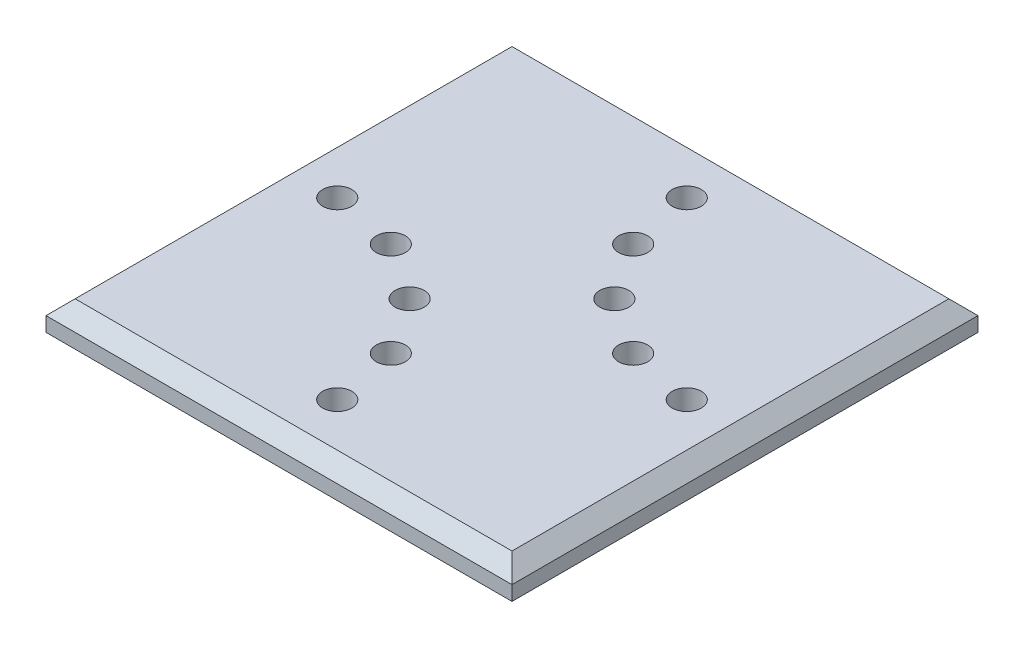
ISO-10303-21;
HEADER;
FILE_DESCRIPTION(('STEP AP214'),'2;1');
FILE_NAME('part.step','',(''),(''),'','','');
FILE_SCHEMA(('AUTOMOTIVE_DESIGN { 1 0 10303 214 1 1 1 1 }'));
ENDSEC;
DATA;
#1=APPLICATION_CONTEXT('core data for automotive mechanical design processes');
#2=APPLICATION_PROTOCOL_DEFINITION('international standard','automotive_design',2000,#1);
#3=PRODUCT_CONTEXT('',#1,'mechanical');
#4=PRODUCT('Part','Part','',(#3));
#5=PRODUCT_RELATED_PRODUCT_CATEGORY('part','',(#4));
#6=PRODUCT_DEFINITION_FORMATION('','',#4);
#7=PRODUCT_DEFINITION_CONTEXT('part definition',#1,'design');
#8=PRODUCT_DEFINITION('design','',#6,#7);
#9=PRODUCT_DEFINITION_SHAPE('','',#8);
#10=(LENGTH_UNIT() NAMED_UNIT(*) SI_UNIT(.MILLI.,.METRE.));
#11=(NAMED_UNIT(*) PLANE_ANGLE_UNIT() SI_UNIT($,.RADIAN.));
#12=(NAMED_UNIT(*) SI_UNIT($,.STERADIAN.) SOLID_ANGLE_UNIT());
#13=UNCERTAINTY_MEASURE_WITH_UNIT(LENGTH_MEASURE(1.E-05),#10,'distance_accuracy_value','');
#14=(GEOMETRIC_REPRESENTATION_CONTEXT(3) GLOBAL_UNCERTAINTY_ASSIGNED_CONTEXT((#13)) GLOBAL_UNIT_ASSIGNED_CONTEXT((#10,
#11,#12)) REPRESENTATION_CONTEXT('',''));
#15=CARTESIAN_POINT('',(0.,0.,0.));
#16=DIRECTION('',(0.,0.,1.));
#17=DIRECTION('',(1.,0.,0.));
#18=AXIS2_PLACEMENT_3D('',#15,#16,#17);
#19=CARTESIAN_POINT('',(50.8,9.525,50.8));
#20=DIRECTION('',(-1.,0.,0.));
#21=DIRECTION('',(0.,0.,1.));
#22=AXIS2_PLACEMENT_3D('',#19,#20,#21);
#23=PLANE('',#22);
#24=DIRECTION('',(0.,-1.,0.));
#25=VECTOR('',#24,1.);
#26=CARTESIAN_POINT('',(50.8,9.525,-50.8));
#27=LINE('',#26,#25);
#28=CARTESIAN_POINT('',(50.8,6.34999999999995,-50.8));
#29=VERTEX_POINT('',#28);
#30=CARTESIAN_POINT('',(50.8,3.175,-50.8));
#31=VERTEX_POINT('',#30);
#32=EDGE_CURVE('E175',#29,#31,#27,.T.);
#33=ORIENTED_EDGE('',*,*,#32,.F.);
#34=DIRECTION('',(0.,0.,1.));
#35=VECTOR('',#34,1.);
#36=CARTESIAN_POINT('',(50.8,6.34999999999995,50.8));
#37=LINE('',#36,#35);
#38=CARTESIAN_POINT('',(50.8,6.34999999999995,50.8));
#39=VERTEX_POINT('',#38);
#40=EDGE_CURVE('E11',#29,#39,#37,.T.);
#41=ORIENTED_EDGE('',*,*,#40,.T.);
#42=DIRECTION('',(0.,-1.,0.));
#43=VECTOR('',#42,1.);
#44=CARTESIAN_POINT('',(50.8,9.525,50.8));
#45=LINE('',#44,#43);
#46=CARTESIAN_POINT('',(50.8,3.175,50.8));
#47=VERTEX_POINT('',#46);
#48=EDGE_CURVE('E169',#39,#47,#45,.T.);
#49=ORIENTED_EDGE('',*,*,#48,.T.);
#50=DIRECTION('',(0.,0.,1.));
#51=VECTOR('',#50,1.);
#52=CARTESIAN_POINT('',(50.8,3.175,-50.8));
#53=LINE('',#52,#51);
#54=EDGE_CURVE('E160',#31,#47,#53,.T.);
#55=ORIENTED_EDGE('',*,*,#54,.F.);
#56=EDGE_LOOP('',(#33,#41,#49,#55));
#57=FACE_BOUND('',#56,.T.);
#58=ADVANCED_FACE('F32',(#57),#23,.F.);
#59=CARTESIAN_POINT('',(-50.8,9.525,-50.8));
#60=DIRECTION('',(0.,0.,1.));
#61=DIRECTION('',(1.,0.,0.));
#62=AXIS2_PLACEMENT_3D('',#59,#60,#61);
#63=PLANE('',#62);
#64=DIRECTION('',(0.,-1.,0.));
#65=VECTOR('',#64,1.);
#66=CARTESIAN_POINT('',(-50.8,9.525,-50.8));
#67=LINE('',#66,#65);
#68=CARTESIAN_POINT('',(-50.8,6.34999999999995,-50.8));
#69=VERTEX_POINT('',#68);
#70=CARTESIAN_POINT('',(-50.8,3.175,-50.8));
#71=VERTEX_POINT('',#70);
#72=EDGE_CURVE('E173',#69,#71,#67,.T.);
#73=ORIENTED_EDGE('',*,*,#72,.F.);
#74=DIRECTION('',(1.,0.,0.));
#75=VECTOR('',#74,1.);
#76=CARTESIAN_POINT('',(-50.8,6.34999999999995,-50.8));
#77=LINE('',#76,#75);
#78=EDGE_CURVE('E41',#69,#29,#77,.T.);
#79=ORIENTED_EDGE('',*,*,#78,.T.);
#80=ORIENTED_EDGE('',*,*,#32,.T.);
#81=DIRECTION('',(1.,0.,0.));
#82=VECTOR('',#81,1.);
#83=CARTESIAN_POINT('',(-50.8,3.175,-50.8));
#84=LINE('',#83,#82);
#85=EDGE_CURVE('E154',#71,#31,#84,.T.);
#86=ORIENTED_EDGE('',*,*,#85,.F.);
#87=EDGE_LOOP('',(#73,#79,#80,#86));
#88=FACE_BOUND('',#87,.T.);
#89=ADVANCED_FACE('F236',(#88),#63,.F.);
#90=CARTESIAN_POINT('',(-50.8,9.525,50.8));
#91=DIRECTION('',(1.,0.,0.));
#92=DIRECTION('',(0.,0.,-1.));
#93=AXIS2_PLACEMENT_3D('',#90,#91,#92);
#94=PLANE('',#93);
#95=DIRECTION('',(0.,-1.,0.));
#96=VECTOR('',#95,1.);
#97=CARTESIAN_POINT('',(-50.8,9.525,50.8));
#98=LINE('',#97,#96);
#99=CARTESIAN_POINT('',(-50.8,6.34999999999995,50.8));
#100=VERTEX_POINT('',#99);
#101=CARTESIAN_POINT('',(-50.8,3.175,50.8));
#102=VERTEX_POINT('',#101);
#103=EDGE_CURVE('E171',#100,#102,#98,.T.);
#104=ORIENTED_EDGE('',*,*,#103,.F.);
#105=DIRECTION('',(0.,0.,-1.));
#106=VECTOR('',#105,1.);
#107=CARTESIAN_POINT('',(-50.8,6.34999999999995,50.8));
#108=LINE('',#107,#106);
#109=EDGE_CURVE('E56',#100,#69,#108,.T.);
#110=ORIENTED_EDGE('',*,*,#109,.T.);
#111=ORIENTED_EDGE('',*,*,#72,.T.);
#112=DIRECTION('',(0.,0.,-1.));
#113=VECTOR('',#112,1.);
#114=CARTESIAN_POINT('',(-50.8,3.175,50.8));
#115=LINE('',#114,#113);
#116=EDGE_CURVE('E166',#102,#71,#115,.T.);
#117=ORIENTED_EDGE('',*,*,#116,.F.);
#118=EDGE_LOOP('',(#104,#110,#111,#117));
#119=FACE_BOUND('',#118,.T.);
#120=ADVANCED_FACE('F230',(#119),#94,.F.);
#121=CARTESIAN_POINT('',(-50.8,9.525,50.8));
#122=DIRECTION('',(0.,0.,-1.));
#123=DIRECTION('',(-1.,0.,0.));
#124=AXIS2_PLACEMENT_3D('',#121,#122,#123);
#125=PLANE('',#124);
#126=ORIENTED_EDGE('',*,*,#48,.F.);
#127=DIRECTION('',(-1.,0.,0.));
#128=VECTOR('',#127,1.);
#129=CARTESIAN_POINT('',(-50.8,6.34999999999995,50.8));
#130=LINE('',#129,#128);
#131=EDGE_CURVE('E186',#39,#100,#130,.T.);
#132=ORIENTED_EDGE('',*,*,#131,.T.);
#133=ORIENTED_EDGE('',*,*,#103,.T.);
#134=DIRECTION('',(-1.,0.,0.));
#135=VECTOR('',#134,1.);
#136=CARTESIAN_POINT('',(50.8,3.175,50.8));
#137=LINE('',#136,#135);
#138=EDGE_CURVE('E163',#47,#102,#137,.T.);
#139=ORIENTED_EDGE('',*,*,#138,.F.);
#140=EDGE_LOOP('',(#126,#132,#133,#139));
#141=FACE_BOUND('',#140,.T.);
#142=ADVANCED_FACE('F216',(#141),#125,.F.);
#143=CARTESIAN_POINT('',(0.,9.525,0.));
#144=DIRECTION('',(0.,-1.,0.));
#145=DIRECTION('',(0.,0.,-1.));
#146=AXIS2_PLACEMENT_3D('',#143,#144,#145);
#147=PLANE('',#146);
#148=CARTESIAN_POINT('',(-38.1,9.525,0.));
#149=DIRECTION('',(0.,-1.,0.));
#150=DIRECTION('',(0.,0.,-1.));
#151=AXIS2_PLACEMENT_3D('',#148,#149,#150);
#152=CIRCLE('',#151,3.175);
#153=CARTESIAN_POINT('',(-38.1,9.525,-3.175));
#154=VERTEX_POINT('',#153);
#155=EDGE_CURVE('E143',#154,#154,#152,.T.);
#156=ORIENTED_EDGE('',*,*,#155,.T.);
#157=EDGE_LOOP('',(#156));
#158=FACE_BOUND('',#157,.T.);
#159=CARTESIAN_POINT('',(2.90018981132002,9.525,-23.5197612268899));
#160=DIRECTION('',(0.,-1.,0.));
#161=DIRECTION('',(0.,0.,-1.));
#162=AXIS2_PLACEMENT_3D('',#159,#160,#161);
#163=CIRCLE('',#162,3.17499999999999);
#164=CARTESIAN_POINT('',(2.90018981132002,9.525,-26.6947612268899));
#165=VERTEX_POINT('',#164);
#166=EDGE_CURVE('E461',#165,#165,#163,.T.);
#167=ORIENTED_EDGE('',*,*,#166,.T.);
#168=EDGE_LOOP('',(#167));
#169=FACE_BOUND('',#168,.T.);
#170=CARTESIAN_POINT('',(11.1592316367925,9.525,-11.1592316367925));
#171=DIRECTION('',(0.,-1.,0.));
#172=DIRECTION('',(0.,0.,-1.));
#173=AXIS2_PLACEMENT_3D('',#170,#171,#172);
#174=CIRCLE('',#173,3.17500000000001);
#175=CARTESIAN_POINT('',(11.1592316367925,9.525,-14.3342316367926));
#176=VERTEX_POINT('',#175);
#177=EDGE_CURVE('E463',#176,#176,#174,.T.);
#178=ORIENTED_EDGE('',*,*,#177,.T.);
#179=EDGE_LOOP('',(#178));
#180=FACE_BOUND('',#179,.T.);
#181=CARTESIAN_POINT('',(23.51976122689,9.525,-2.90018981132001));
#182=DIRECTION('',(0.,-1.,0.));
#183=DIRECTION('',(0.,0.,-1.));
#184=AXIS2_PLACEMENT_3D('',#181,#182,#183);
#185=CIRCLE('',#184,3.17499999999999);
#186=CARTESIAN_POINT('',(23.51976122689,9.525,-6.07518981132));
#187=VERTEX_POINT('',#186);
#188=EDGE_CURVE('E466',#187,#187,#185,.T.);
#189=ORIENTED_EDGE('',*,*,#188,.T.);
#190=EDGE_LOOP('',(#189));
#191=FACE_BOUND('',#190,.T.);
#192=CARTESIAN_POINT('',(38.1,9.525,0.));
#193=DIRECTION('',(0.,-1.,0.));
#194=DIRECTION('',(0.,0.,-1.));
#195=AXIS2_PLACEMENT_3D('',#192,#193,#194);
#196=CIRCLE('',#195,3.175);
#197=CARTESIAN_POINT('',(38.1,9.525,-3.17500000000003));
#198=VERTEX_POINT('',#197);
#199=EDGE_CURVE('E471',#198,#198,#196,.T.);
#200=ORIENTED_EDGE('',*,*,#199,.T.);
#201=EDGE_LOOP('',(#200));
#202=FACE_BOUND('',#201,.T.);
#203=CARTESIAN_POINT('',(0.,9.525,38.1));
#204=DIRECTION('',(0.,-1.,0.));
#205=DIRECTION('',(0.,0.,-1.));
#206=AXIS2_PLACEMENT_3D('',#203,#204,#205);
#207=CIRCLE('',#206,3.175);
#208=CARTESIAN_POINT('',(0.,9.525,34.925));
#209=VERTEX_POINT('',#208);
#210=EDGE_CURVE('E474',#209,#209,#207,.T.);
#211=ORIENTED_EDGE('',*,*,#210,.T.);
#212=EDGE_LOOP('',(#211));
#213=FACE_BOUND('',#212,.T.);
#214=CARTESIAN_POINT('',(-11.1592316367925,9.525,11.1592316367925));
#215=DIRECTION('',(0.,-1.,0.));
#216=DIRECTION('',(0.,0.,-1.));
#217=AXIS2_PLACEMENT_3D('',#214,#215,#216);
#218=CIRCLE('',#217,3.175);
#219=CARTESIAN_POINT('',(-11.1592316367925,9.525,7.98423163679253));
#220=VERTEX_POINT('',#219);
#221=EDGE_CURVE('E477',#220,#220,#218,.T.);
#222=ORIENTED_EDGE('',*,*,#221,.T.);
#223=EDGE_LOOP('',(#222));
#224=FACE_BOUND('',#223,.T.);
#225=CARTESIAN_POINT('',(-23.5197612268899,9.525,2.90018981132003));
#226=DIRECTION('',(0.,-1.,0.));
#227=DIRECTION('',(0.,0.,-1.));
#228=AXIS2_PLACEMENT_3D('',#225,#226,#227);
#229=CIRCLE('',#228,3.175);
#230=CARTESIAN_POINT('',(-23.5197612268899,9.525,-0.274810188679971));
#231=VERTEX_POINT('',#230);
#232=EDGE_CURVE('E480',#231,#231,#229,.T.);
#233=ORIENTED_EDGE('',*,*,#232,.T.);
#234=EDGE_LOOP('',(#233));
#235=FACE_BOUND('',#234,.T.);
#236=CARTESIAN_POINT('',(-2.90018981131998,9.525,23.5197612268901));
#237=DIRECTION('',(0.,-1.,0.));
#238=DIRECTION('',(0.,0.,-1.));
#239=AXIS2_PLACEMENT_3D('',#236,#237,#238);
#240=CIRCLE('',#239,3.175);
#241=CARTESIAN_POINT('',(-2.90018981131998,9.525,20.34476122689));
#242=VERTEX_POINT('',#241);
#243=EDGE_CURVE('E483',#242,#242,#240,.T.);
#244=ORIENTED_EDGE('',*,*,#243,.T.);
#245=EDGE_LOOP('',(#244));
#246=FACE_BOUND('',#245,.T.);
#247=CARTESIAN_POINT('',(0.,9.525,-38.1));
#248=DIRECTION('',(0.,-1.,0.));
#249=DIRECTION('',(0.,0.,-1.));
#250=AXIS2_PLACEMENT_3D('',#247,#248,#249);
#251=CIRCLE('',#250,3.175);
#252=CARTESIAN_POINT('',(0.,9.525,-41.275));
#253=VERTEX_POINT('',#252);
#254=EDGE_CURVE('E486',#253,#253,#251,.T.);
#255=ORIENTED_EDGE('',*,*,#254,.T.);
#256=EDGE_LOOP('',(#255));
#257=FACE_BOUND('',#256,.T.);
#258=DIRECTION('',(0.,0.,1.));
#259=VECTOR('',#258,1.);
#260=CARTESIAN_POINT('',(-47.625,9.525,0.));
#261=LINE('',#260,#259);
#262=CARTESIAN_POINT('',(-47.625,9.525,-47.625));
#263=VERTEX_POINT('',#262);
#264=CARTESIAN_POINT('',(-47.625,9.525,47.625));
#265=VERTEX_POINT('',#264);
#266=EDGE_CURVE('E181',#263,#265,#261,.T.);
#267=ORIENTED_EDGE('',*,*,#266,.T.);
#268=DIRECTION('',(1.,0.,0.));
#269=VECTOR('',#268,1.);
#270=CARTESIAN_POINT('',(0.,9.525,47.625));
#271=LINE('',#270,#269);
#272=CARTESIAN_POINT('',(47.625,9.525,47.625));
#273=VERTEX_POINT('',#272);
#274=EDGE_CURVE('E183',#265,#273,#271,.T.);
#275=ORIENTED_EDGE('',*,*,#274,.T.);
#276=DIRECTION('',(0.,0.,-1.));
#277=VECTOR('',#276,1.);
#278=CARTESIAN_POINT('',(47.625,9.525,0.));
#279=LINE('',#278,#277);
#280=CARTESIAN_POINT('',(47.625,9.525,-47.625));
#281=VERTEX_POINT('',#280);
#282=EDGE_CURVE('E177',#273,#281,#279,.T.);
#283=ORIENTED_EDGE('',*,*,#282,.T.);
#284=DIRECTION('',(-1.,0.,0.));
#285=VECTOR('',#284,1.);
#286=CARTESIAN_POINT('',(0.,9.525,-47.625));
#287=LINE('',#286,#285);
#288=EDGE_CURVE('E179',#281,#263,#287,.T.);
#289=ORIENTED_EDGE('',*,*,#288,.T.);
#290=EDGE_LOOP('',(#267,#275,#283,#289));
#291=FACE_BOUND('',#290,.T.);
#292=ADVANCED_FACE('F221',(#158,#169,#180,#191,#202,#213,#224,#235,#246,#257,#291),#147,.F.);
#293=CARTESIAN_POINT('',(0.,3.175,0.));
#294=DIRECTION('',(0.,-1.,0.));
#295=DIRECTION('',(0.,0.,-1.));
#296=AXIS2_PLACEMENT_3D('',#293,#294,#295);
#297=PLANE('',#296);
#298=DIRECTION('',(1.,0.,0.));
#299=VECTOR('',#298,1.);
#300=CARTESIAN_POINT('',(-47.498,3.175,-47.498));
#301=LINE('',#300,#299);
#302=CARTESIAN_POINT('',(-47.498,3.175,-47.498));
#303=VERTEX_POINT('',#302);
#304=CARTESIAN_POINT('',(47.498,3.175,-47.498));
#305=VERTEX_POINT('',#304);
#306=EDGE_CURVE('E122',#303,#305,#301,.T.);
#307=ORIENTED_EDGE('',*,*,#306,.F.);
#308=DIRECTION('',(0.,0.,-1.));
#309=VECTOR('',#308,1.);
#310=CARTESIAN_POINT('',(-47.498,3.175,47.498));
#311=LINE('',#310,#309);
#312=CARTESIAN_POINT('',(-47.498,3.175,47.498));
#313=VERTEX_POINT('',#312);
#314=EDGE_CURVE('E132',#313,#303,#311,.T.);
#315=ORIENTED_EDGE('',*,*,#314,.F.);
#316=DIRECTION('',(-1.,0.,0.));
#317=VECTOR('',#316,1.);
#318=CARTESIAN_POINT('',(47.498,3.175,47.498));
#319=LINE('',#318,#317);
#320=CARTESIAN_POINT('',(47.498,3.175,47.498));
#321=VERTEX_POINT('',#320);
#322=EDGE_CURVE('E114',#321,#313,#319,.T.);
#323=ORIENTED_EDGE('',*,*,#322,.F.);
#324=DIRECTION('',(0.,0.,1.));
#325=VECTOR('',#324,1.);
#326=CARTESIAN_POINT('',(47.498,3.175,-47.498));
#327=LINE('',#326,#325);
#328=EDGE_CURVE('E129',#305,#321,#327,.T.);
#329=ORIENTED_EDGE('',*,*,#328,.F.);
#330=EDGE_LOOP('',(#307,#315,#323,#329));
#331=FACE_BOUND('',#330,.T.);
#332=ORIENTED_EDGE('',*,*,#85,.T.);
#333=ORIENTED_EDGE('',*,*,#54,.T.);
#334=ORIENTED_EDGE('',*,*,#138,.T.);
#335=ORIENTED_EDGE('',*,*,#116,.T.);
#336=EDGE_LOOP('',(#332,#333,#334,#335));
#337=FACE_BOUND('',#336,.T.);
#338=ADVANCED_FACE('F127',(#331,#337),#297,.T.);
#339=CARTESIAN_POINT('',(47.498,3.175,-47.498));
#340=DIRECTION('',(1.,0.,0.));
#341=DIRECTION('',(0.,0.,-1.));
#342=AXIS2_PLACEMENT_3D('',#339,#340,#341);
#343=PLANE('',#342);
#344=DIRECTION('',(0.,0.,1.));
#345=VECTOR('',#344,1.);
#346=CARTESIAN_POINT('',(47.498,0.,-47.498));
#347=LINE('',#346,#345);
#348=CARTESIAN_POINT('',(47.498,0.,-47.498));
#349=VERTEX_POINT('',#348);
#350=CARTESIAN_POINT('',(47.498,0.,47.498));
#351=VERTEX_POINT('',#350);
#352=EDGE_CURVE('E148',#349,#351,#347,.T.);
#353=ORIENTED_EDGE('',*,*,#352,.F.);
#354=DIRECTION('',(0.,-1.,0.));
#355=VECTOR('',#354,1.);
#356=CARTESIAN_POINT('',(47.498,3.175,-47.498));
#357=LINE('',#356,#355);
#358=EDGE_CURVE('E136',#305,#349,#357,.T.);
#359=ORIENTED_EDGE('',*,*,#358,.F.);
#360=ORIENTED_EDGE('',*,*,#328,.T.);
#361=DIRECTION('',(0.,-1.,0.));
#362=VECTOR('',#361,1.);
#363=CARTESIAN_POINT('',(47.498,3.175,47.498));
#364=LINE('',#363,#362);
#365=EDGE_CURVE('E110',#321,#351,#364,.T.);
#366=ORIENTED_EDGE('',*,*,#365,.T.);
#367=EDGE_LOOP('',(#353,#359,#360,#366));
#368=FACE_BOUND('',#367,.T.);
#369=ADVANCED_FACE('F135',(#368),#343,.T.);
#370=CARTESIAN_POINT('',(-47.498,3.175,-47.498));
#371=DIRECTION('',(0.,0.,-1.));
#372=DIRECTION('',(-1.,0.,0.));
#373=AXIS2_PLACEMENT_3D('',#370,#371,#372);
#374=PLANE('',#373);
#375=DIRECTION('',(1.,0.,0.));
#376=VECTOR('',#375,1.);
#377=CARTESIAN_POINT('',(-47.498,0.,-47.498));
#378=LINE('',#377,#376);
#379=CARTESIAN_POINT('',(-47.498,0.,-47.498));
#380=VERTEX_POINT('',#379);
#381=EDGE_CURVE('E137',#380,#349,#378,.T.);
#382=ORIENTED_EDGE('',*,*,#381,.F.);
#383=DIRECTION('',(0.,-1.,0.));
#384=VECTOR('',#383,1.);
#385=CARTESIAN_POINT('',(-47.498,3.175,-47.498));
#386=LINE('',#385,#384);
#387=EDGE_CURVE('E155',#303,#380,#386,.T.);
#388=ORIENTED_EDGE('',*,*,#387,.F.);
#389=ORIENTED_EDGE('',*,*,#306,.T.);
#390=ORIENTED_EDGE('',*,*,#358,.T.);
#391=EDGE_LOOP('',(#382,#388,#389,#390));
#392=FACE_BOUND('',#391,.T.);
#393=ADVANCED_FACE('F410',(#392),#374,.T.);
#394=CARTESIAN_POINT('',(-47.498,3.175,47.498));
#395=DIRECTION('',(-1.,0.,0.));
#396=DIRECTION('',(0.,0.,1.));
#397=AXIS2_PLACEMENT_3D('',#394,#395,#396);
#398=PLANE('',#397);
#399=DIRECTION('',(0.,0.,-1.));
#400=VECTOR('',#399,1.);
#401=CARTESIAN_POINT('',(-47.498,0.,47.498));
#402=LINE('',#401,#400);
#403=CARTESIAN_POINT('',(-47.498,0.,47.498));
#404=VERTEX_POINT('',#403);
#405=EDGE_CURVE('E140',#404,#380,#402,.T.);
#406=ORIENTED_EDGE('',*,*,#405,.F.);
#407=DIRECTION('',(0.,-1.,0.));
#408=VECTOR('',#407,1.);
#409=CARTESIAN_POINT('',(-47.498,3.175,47.498));
#410=LINE('',#409,#408);
#411=EDGE_CURVE('E121',#313,#404,#410,.T.);
#412=ORIENTED_EDGE('',*,*,#411,.F.);
#413=ORIENTED_EDGE('',*,*,#314,.T.);
#414=ORIENTED_EDGE('',*,*,#387,.T.);
#415=EDGE_LOOP('',(#406,#412,#413,#414));
#416=FACE_BOUND('',#415,.T.);
#417=ADVANCED_FACE('F260',(#416),#398,.T.);
#418=CARTESIAN_POINT('',(47.498,3.175,47.498));
#419=DIRECTION('',(0.,0.,1.));
#420=DIRECTION('',(1.,0.,0.));
#421=AXIS2_PLACEMENT_3D('',#418,#419,#420);
#422=PLANE('',#421);
#423=DIRECTION('',(-1.,0.,0.));
#424=VECTOR('',#423,1.);
#425=CARTESIAN_POINT('',(47.498,0.,47.498));
#426=LINE('',#425,#424);
#427=EDGE_CURVE('E116',#351,#404,#426,.T.);
#428=ORIENTED_EDGE('',*,*,#427,.F.);
#429=ORIENTED_EDGE('',*,*,#365,.F.);
#430=ORIENTED_EDGE('',*,*,#322,.T.);
#431=ORIENTED_EDGE('',*,*,#411,.T.);
#432=EDGE_LOOP('',(#428,#429,#430,#431));
#433=FACE_BOUND('',#432,.T.);
#434=ADVANCED_FACE('F112',(#433),#422,.T.);
#435=CARTESIAN_POINT('',(0.,0.,0.));
#436=DIRECTION('',(0.,-1.,0.));
#437=DIRECTION('',(0.,0.,-1.));
#438=AXIS2_PLACEMENT_3D('',#435,#436,#437);
#439=PLANE('',#438);
#440=CARTESIAN_POINT('',(-38.1,0.,0.));
#441=DIRECTION('',(0.,1.,0.));
#442=DIRECTION('',(0.,0.,1.));
#443=AXIS2_PLACEMENT_3D('',#440,#441,#442);
#444=CIRCLE('',#443,3.175);
#445=CARTESIAN_POINT('',(-38.1,0.,3.17499999999999));
#446=VERTEX_POINT('',#445);
#447=EDGE_CURVE('E459',#446,#446,#444,.T.);
#448=ORIENTED_EDGE('',*,*,#447,.T.);
#449=EDGE_LOOP('',(#448));
#450=FACE_BOUND('',#449,.T.);
#451=CARTESIAN_POINT('',(2.90018981132002,0.,-23.5197612268899));
#452=DIRECTION('',(0.,1.,0.));
#453=DIRECTION('',(0.,0.,-1.));
#454=AXIS2_PLACEMENT_3D('',#451,#452,#453);
#455=CIRCLE('',#454,3.17499999999999);
#456=CARTESIAN_POINT('',(2.90018981132002,0.,-26.6947612268899));
#457=VERTEX_POINT('',#456);
#458=EDGE_CURVE('E492',#457,#457,#455,.T.);
#459=ORIENTED_EDGE('',*,*,#458,.T.);
#460=EDGE_LOOP('',(#459));
#461=FACE_BOUND('',#460,.T.);
#462=CARTESIAN_POINT('',(11.1592316367925,0.,-11.1592316367925));
#463=DIRECTION('',(0.,1.,0.));
#464=DIRECTION('',(0.,0.,-1.));
#465=AXIS2_PLACEMENT_3D('',#462,#463,#464);
#466=CIRCLE('',#465,3.17500000000001);
#467=CARTESIAN_POINT('',(11.1592316367925,0.,-14.3342316367926));
#468=VERTEX_POINT('',#467);
#469=EDGE_CURVE('E508',#468,#468,#466,.T.);
#470=ORIENTED_EDGE('',*,*,#469,.T.);
#471=EDGE_LOOP('',(#470));
#472=FACE_BOUND('',#471,.T.);
#473=CARTESIAN_POINT('',(23.51976122689,0.,-2.90018981132001));
#474=DIRECTION('',(0.,1.,0.));
#475=DIRECTION('',(0.,0.,-1.));
#476=AXIS2_PLACEMENT_3D('',#473,#474,#475);
#477=CIRCLE('',#476,3.17499999999999);
#478=CARTESIAN_POINT('',(23.51976122689,0.,-6.07518981132));
#479=VERTEX_POINT('',#478);
#480=EDGE_CURVE('E511',#479,#479,#477,.T.);
#481=ORIENTED_EDGE('',*,*,#480,.T.);
#482=EDGE_LOOP('',(#481));
#483=FACE_BOUND('',#482,.T.);
#484=CARTESIAN_POINT('',(38.1,0.,0.));
#485=DIRECTION('',(0.,1.,0.));
#486=DIRECTION('',(0.,0.,-1.));
#487=AXIS2_PLACEMENT_3D('',#484,#485,#486);
#488=CIRCLE('',#487,3.175);
#489=CARTESIAN_POINT('',(38.1,0.,-3.17500000000003));
#490=VERTEX_POINT('',#489);
#491=EDGE_CURVE('E503',#490,#490,#488,.T.);
#492=ORIENTED_EDGE('',*,*,#491,.T.);
#493=EDGE_LOOP('',(#492));
#494=FACE_BOUND('',#493,.T.);
#495=CARTESIAN_POINT('',(0.,0.,38.1));
#496=DIRECTION('',(0.,1.,0.));
#497=DIRECTION('',(0.,0.,1.));
#498=AXIS2_PLACEMENT_3D('',#495,#496,#497);
#499=CIRCLE('',#498,3.175);
#500=CARTESIAN_POINT('',(0.,0.,41.275));
#501=VERTEX_POINT('',#500);
#502=EDGE_CURVE('E496',#501,#501,#499,.T.);
#503=ORIENTED_EDGE('',*,*,#502,.T.);
#504=EDGE_LOOP('',(#503));
#505=FACE_BOUND('',#504,.T.);
#506=CARTESIAN_POINT('',(-11.1592316367925,0.,11.1592316367925));
#507=DIRECTION('',(0.,1.,0.));
#508=DIRECTION('',(0.,0.,1.));
#509=AXIS2_PLACEMENT_3D('',#506,#507,#508);
#510=CIRCLE('',#509,3.175);
#511=CARTESIAN_POINT('',(-11.1592316367925,0.,14.3342316367925));
#512=VERTEX_POINT('',#511);
#513=EDGE_CURVE('E493',#512,#512,#510,.T.);
#514=ORIENTED_EDGE('',*,*,#513,.T.);
#515=EDGE_LOOP('',(#514));
#516=FACE_BOUND('',#515,.T.);
#517=CARTESIAN_POINT('',(-23.5197612268899,0.,2.90018981132003));
#518=DIRECTION('',(0.,1.,0.));
#519=DIRECTION('',(0.,0.,1.));
#520=AXIS2_PLACEMENT_3D('',#517,#518,#519);
#521=CIRCLE('',#520,3.175);
#522=CARTESIAN_POINT('',(-23.5197612268899,0.,6.07518981132003));
#523=VERTEX_POINT('',#522);
#524=EDGE_CURVE('E497',#523,#523,#521,.T.);
#525=ORIENTED_EDGE('',*,*,#524,.T.);
#526=EDGE_LOOP('',(#525));
#527=FACE_BOUND('',#526,.T.);
#528=CARTESIAN_POINT('',(-2.90018981131998,0.,23.5197612268901));
#529=DIRECTION('',(0.,1.,0.));
#530=DIRECTION('',(0.,0.,1.));
#531=AXIS2_PLACEMENT_3D('',#528,#529,#530);
#532=CIRCLE('',#531,3.175);
#533=CARTESIAN_POINT('',(-2.90018981131998,0.,26.6947612268901));
#534=VERTEX_POINT('',#533);
#535=EDGE_CURVE('E500',#534,#534,#532,.T.);
#536=ORIENTED_EDGE('',*,*,#535,.T.);
#537=EDGE_LOOP('',(#536));
#538=FACE_BOUND('',#537,.T.);
#539=CARTESIAN_POINT('',(0.,0.,-38.1));
#540=DIRECTION('',(0.,1.,0.));
#541=DIRECTION('',(0.,0.,-1.));
#542=AXIS2_PLACEMENT_3D('',#539,#540,#541);
#543=CIRCLE('',#542,3.175);
#544=CARTESIAN_POINT('',(0.,0.,-41.275));
#545=VERTEX_POINT('',#544);
#546=EDGE_CURVE('E489',#545,#545,#543,.T.);
#547=ORIENTED_EDGE('',*,*,#546,.T.);
#548=EDGE_LOOP('',(#547));
#549=FACE_BOUND('',#548,.T.);
#550=ORIENTED_EDGE('',*,*,#381,.T.);
#551=ORIENTED_EDGE('',*,*,#352,.T.);
#552=ORIENTED_EDGE('',*,*,#427,.T.);
#553=ORIENTED_EDGE('',*,*,#405,.T.);
#554=EDGE_LOOP('',(#550,#551,#552,#553));
#555=FACE_BOUND('',#554,.T.);
#556=ADVANCED_FACE('F252',(#450,#461,#472,#483,#494,#505,#516,#527,#538,#549,#555),#439,.T.);
#557=CARTESIAN_POINT('',(0.,9.525,-47.625));
#558=DIRECTION('',(0.,-0.707106781186546,0.707106781186549));
#559=DIRECTION('',(-1.,0.,0.));
#560=AXIS2_PLACEMENT_3D('',#557,#558,#559);
#561=PLANE('',#560);
#562=DIRECTION('',(-0.577350269189625,0.577350269189628,0.577350269189625));
#563=VECTOR('',#562,1.);
#564=CARTESIAN_POINT('',(31.75,25.4,-31.75));
#565=LINE('',#564,#563);
#566=EDGE_CURVE('E194',#29,#281,#565,.T.);
#567=ORIENTED_EDGE('',*,*,#566,.F.);
#568=ORIENTED_EDGE('',*,*,#78,.F.);
#569=DIRECTION('',(0.577350269189625,0.577350269189628,0.577350269189625));
#570=VECTOR('',#569,1.);
#571=CARTESIAN_POINT('',(-31.75,25.4,-31.75));
#572=LINE('',#571,#570);
#573=EDGE_CURVE('E36',#263,#69,#572,.F.);
#574=ORIENTED_EDGE('',*,*,#573,.F.);
#575=ORIENTED_EDGE('',*,*,#288,.F.);
#576=EDGE_LOOP('',(#567,#568,#574,#575));
#577=FACE_BOUND('',#576,.T.);
#578=ADVANCED_FACE('F34',(#577),#561,.F.);
#579=CARTESIAN_POINT('',(-47.625,9.525,0.));
#580=DIRECTION('',(0.707106781186549,-0.707106781186546,0.));
#581=DIRECTION('',(0.,0.,1.));
#582=AXIS2_PLACEMENT_3D('',#579,#580,#581);
#583=PLANE('',#582);
#584=ORIENTED_EDGE('',*,*,#573,.T.);
#585=ORIENTED_EDGE('',*,*,#109,.F.);
#586=DIRECTION('',(0.577350269189625,0.577350269189628,-0.577350269189625));
#587=VECTOR('',#586,1.);
#588=CARTESIAN_POINT('',(-31.75,25.4,31.75));
#589=LINE('',#588,#587);
#590=EDGE_CURVE('E193',#265,#100,#589,.F.);
#591=ORIENTED_EDGE('',*,*,#590,.F.);
#592=ORIENTED_EDGE('',*,*,#266,.F.);
#593=EDGE_LOOP('',(#584,#585,#591,#592));
#594=FACE_BOUND('',#593,.T.);
#595=ADVANCED_FACE('F204',(#594),#583,.F.);
#596=CARTESIAN_POINT('',(47.625,9.525,0.));
#597=DIRECTION('',(-0.707106781186549,-0.707106781186546,0.));
#598=DIRECTION('',(0.,0.,-1.));
#599=AXIS2_PLACEMENT_3D('',#596,#597,#598);
#600=PLANE('',#599);
#601=ORIENTED_EDGE('',*,*,#566,.T.);
#602=ORIENTED_EDGE('',*,*,#282,.F.);
#603=DIRECTION('',(0.577350269189625,-0.577350269189628,0.577350269189625));
#604=VECTOR('',#603,1.);
#605=CARTESIAN_POINT('',(31.75,25.4,31.75));
#606=LINE('',#605,#604);
#607=EDGE_CURVE('E191',#39,#273,#606,.F.);
#608=ORIENTED_EDGE('',*,*,#607,.F.);
#609=ORIENTED_EDGE('',*,*,#40,.F.);
#610=EDGE_LOOP('',(#601,#602,#608,#609));
#611=FACE_BOUND('',#610,.T.);
#612=ADVANCED_FACE('F209',(#611),#600,.F.);
#613=CARTESIAN_POINT('',(0.,9.525,47.625));
#614=DIRECTION('',(0.,-0.707106781186546,-0.707106781186549));
#615=DIRECTION('',(1.,0.,0.));
#616=AXIS2_PLACEMENT_3D('',#613,#614,#615);
#617=PLANE('',#616);
#618=ORIENTED_EDGE('',*,*,#590,.T.);
#619=ORIENTED_EDGE('',*,*,#131,.F.);
#620=ORIENTED_EDGE('',*,*,#607,.T.);
#621=ORIENTED_EDGE('',*,*,#274,.F.);
#622=EDGE_LOOP('',(#618,#619,#620,#621));
#623=FACE_BOUND('',#622,.T.);
#624=ADVANCED_FACE('F218',(#623),#617,.F.);
#625=CARTESIAN_POINT('',(0.,0.,-38.1));
#626=DIRECTION('',(0.,1.,0.));
#627=DIRECTION('',(0.,0.,1.));
#628=AXIS2_PLACEMENT_3D('',#625,#626,#627);
#629=CYLINDRICAL_SURFACE('',#628,3.175);
#630=ORIENTED_EDGE('',*,*,#546,.F.);
#631=EDGE_LOOP('',(#630));
#632=FACE_BOUND('',#631,.T.);
#633=ORIENTED_EDGE('',*,*,#254,.F.);
#634=EDGE_LOOP('',(#633));
#635=FACE_BOUND('',#634,.T.);
#636=ADVANCED_FACE('F246',(#632,#635),#629,.F.);
#637=CARTESIAN_POINT('',(-2.90018981131998,0.,23.5197612268901));
#638=DIRECTION('',(0.,1.,0.));
#639=DIRECTION('',(0.,0.,1.));
#640=AXIS2_PLACEMENT_3D('',#637,#638,#639);
#641=CYLINDRICAL_SURFACE('',#640,3.175);
#642=ORIENTED_EDGE('',*,*,#535,.F.);
#643=EDGE_LOOP('',(#642));
#644=FACE_BOUND('',#643,.T.);
#645=ORIENTED_EDGE('',*,*,#243,.F.);
#646=EDGE_LOOP('',(#645));
#647=FACE_BOUND('',#646,.T.);
#648=ADVANCED_FACE('F313',(#644,#647),#641,.F.);
#649=CARTESIAN_POINT('',(-23.5197612268899,0.,2.90018981132003));
#650=DIRECTION('',(0.,1.,0.));
#651=DIRECTION('',(0.,0.,1.));
#652=AXIS2_PLACEMENT_3D('',#649,#650,#651);
#653=CYLINDRICAL_SURFACE('',#652,3.175);
#654=ORIENTED_EDGE('',*,*,#524,.F.);
#655=EDGE_LOOP('',(#654));
#656=FACE_BOUND('',#655,.T.);
#657=ORIENTED_EDGE('',*,*,#232,.F.);
#658=EDGE_LOOP('',(#657));
#659=FACE_BOUND('',#658,.T.);
#660=ADVANCED_FACE('F323',(#656,#659),#653,.F.);
#661=CARTESIAN_POINT('',(-11.1592316367925,0.,11.1592316367925));
#662=DIRECTION('',(0.,1.,0.));
#663=DIRECTION('',(0.,0.,1.));
#664=AXIS2_PLACEMENT_3D('',#661,#662,#663);
#665=CYLINDRICAL_SURFACE('',#664,3.175);
#666=ORIENTED_EDGE('',*,*,#513,.F.);
#667=EDGE_LOOP('',(#666));
#668=FACE_BOUND('',#667,.T.);
#669=ORIENTED_EDGE('',*,*,#221,.F.);
#670=EDGE_LOOP('',(#669));
#671=FACE_BOUND('',#670,.T.);
#672=ADVANCED_FACE('F333',(#668,#671),#665,.F.);
#673=CARTESIAN_POINT('',(0.,0.,38.1));
#674=DIRECTION('',(0.,1.,0.));
#675=DIRECTION('',(0.,0.,1.));
#676=AXIS2_PLACEMENT_3D('',#673,#674,#675);
#677=CYLINDRICAL_SURFACE('',#676,3.175);
#678=ORIENTED_EDGE('',*,*,#502,.F.);
#679=EDGE_LOOP('',(#678));
#680=FACE_BOUND('',#679,.T.);
#681=ORIENTED_EDGE('',*,*,#210,.F.);
#682=EDGE_LOOP('',(#681));
#683=FACE_BOUND('',#682,.T.);
#684=ADVANCED_FACE('F343',(#680,#683),#677,.F.);
#685=CARTESIAN_POINT('',(38.1,0.,0.));
#686=DIRECTION('',(0.,1.,0.));
#687=DIRECTION('',(0.,0.,1.));
#688=AXIS2_PLACEMENT_3D('',#685,#686,#687);
#689=CYLINDRICAL_SURFACE('',#688,3.175);
#690=ORIENTED_EDGE('',*,*,#491,.F.);
#691=EDGE_LOOP('',(#690));
#692=FACE_BOUND('',#691,.T.);
#693=ORIENTED_EDGE('',*,*,#199,.F.);
#694=EDGE_LOOP('',(#693));
#695=FACE_BOUND('',#694,.T.);
#696=ADVANCED_FACE('F353',(#692,#695),#689,.F.);
#697=CARTESIAN_POINT('',(23.51976122689,0.,-2.90018981132001));
#698=DIRECTION('',(0.,1.,0.));
#699=DIRECTION('',(0.,0.,1.));
#700=AXIS2_PLACEMENT_3D('',#697,#698,#699);
#701=CYLINDRICAL_SURFACE('',#700,3.17499999999999);
#702=ORIENTED_EDGE('',*,*,#480,.F.);
#703=EDGE_LOOP('',(#702));
#704=FACE_BOUND('',#703,.T.);
#705=ORIENTED_EDGE('',*,*,#188,.F.);
#706=EDGE_LOOP('',(#705));
#707=FACE_BOUND('',#706,.T.);
#708=ADVANCED_FACE('F363',(#704,#707),#701,.F.);
#709=CARTESIAN_POINT('',(11.1592316367925,0.,-11.1592316367925));
#710=DIRECTION('',(0.,1.,0.));
#711=DIRECTION('',(0.,0.,1.));
#712=AXIS2_PLACEMENT_3D('',#709,#710,#711);
#713=CYLINDRICAL_SURFACE('',#712,3.17500000000001);
#714=ORIENTED_EDGE('',*,*,#469,.F.);
#715=EDGE_LOOP('',(#714));
#716=FACE_BOUND('',#715,.T.);
#717=ORIENTED_EDGE('',*,*,#177,.F.);
#718=EDGE_LOOP('',(#717));
#719=FACE_BOUND('',#718,.T.);
#720=ADVANCED_FACE('F373',(#716,#719),#713,.F.);
#721=CARTESIAN_POINT('',(2.90018981132002,0.,-23.5197612268899));
#722=DIRECTION('',(0.,1.,0.));
#723=DIRECTION('',(0.,0.,1.));
#724=AXIS2_PLACEMENT_3D('',#721,#722,#723);
#725=CYLINDRICAL_SURFACE('',#724,3.17499999999999);
#726=ORIENTED_EDGE('',*,*,#458,.F.);
#727=EDGE_LOOP('',(#726));
#728=FACE_BOUND('',#727,.T.);
#729=ORIENTED_EDGE('',*,*,#166,.F.);
#730=EDGE_LOOP('',(#729));
#731=FACE_BOUND('',#730,.T.);
#732=ADVANCED_FACE('F383',(#728,#731),#725,.F.);
#733=CARTESIAN_POINT('',(-38.1,0.,0.));
#734=DIRECTION('',(0.,1.,0.));
#735=DIRECTION('',(0.,0.,1.));
#736=AXIS2_PLACEMENT_3D('',#733,#734,#735);
#737=CYLINDRICAL_SURFACE('',#736,3.175);
#738=ORIENTED_EDGE('',*,*,#447,.F.);
#739=EDGE_LOOP('',(#738));
#740=FACE_BOUND('',#739,.T.);
#741=ORIENTED_EDGE('',*,*,#155,.F.);
#742=EDGE_LOOP('',(#741));
#743=FACE_BOUND('',#742,.T.);
#744=ADVANCED_FACE('F393',(#740,#743),#737,.F.);
#745=CLOSED_SHELL('',(#58,#89,#120,#142,#292,#338,#369,#393,#417,#434,#556,#578,#595,#612,#624,
#636,#648,#660,#672,#684,#696,#708,#720,#732,#744));
#746=MANIFOLD_SOLID_BREP('B2',#745);
#747=ADVANCED_BREP_SHAPE_REPRESENTATION('',(#18,#746),#14);
#748=SHAPE_DEFINITION_REPRESENTATION(#9,#747);
ENDSEC;
END-ISO-10303-21;
